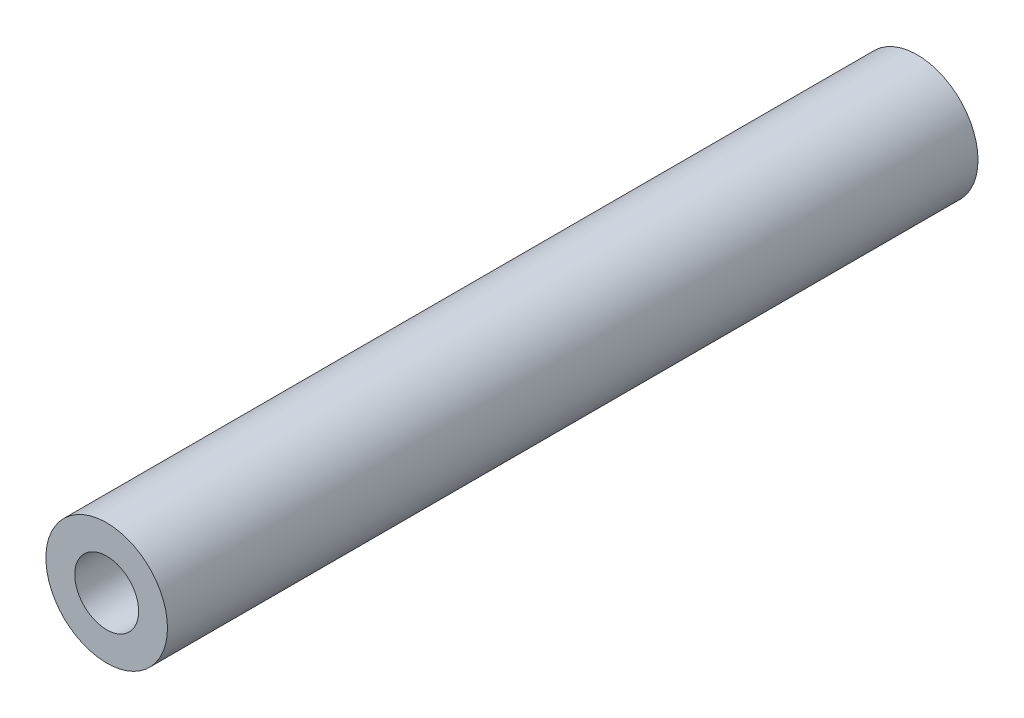
ISO-10303-21;
HEADER;
FILE_DESCRIPTION(('STEP AP214'),'2;1');
FILE_NAME('part.step','',(''),(''),'','','');
FILE_SCHEMA(('AUTOMOTIVE_DESIGN { 1 0 10303 214 1 1 1 1 }'));
ENDSEC;
DATA;
#1=APPLICATION_CONTEXT('core data for automotive mechanical design processes');
#2=APPLICATION_PROTOCOL_DEFINITION('international standard','automotive_design',2000,#1);
#3=PRODUCT_CONTEXT('',#1,'mechanical');
#4=PRODUCT('Part','Part','',(#3));
#5=PRODUCT_RELATED_PRODUCT_CATEGORY('part','',(#4));
#6=PRODUCT_DEFINITION_FORMATION('','',#4);
#7=PRODUCT_DEFINITION_CONTEXT('part definition',#1,'design');
#8=PRODUCT_DEFINITION('design','',#6,#7);
#9=PRODUCT_DEFINITION_SHAPE('','',#8);
#10=(LENGTH_UNIT() NAMED_UNIT(*) SI_UNIT(.MILLI.,.METRE.));
#11=(NAMED_UNIT(*) PLANE_ANGLE_UNIT() SI_UNIT($,.RADIAN.));
#12=(NAMED_UNIT(*) SI_UNIT($,.STERADIAN.) SOLID_ANGLE_UNIT());
#13=UNCERTAINTY_MEASURE_WITH_UNIT(LENGTH_MEASURE(1.E-05),#10,'distance_accuracy_value','');
#14=(GEOMETRIC_REPRESENTATION_CONTEXT(3) GLOBAL_UNCERTAINTY_ASSIGNED_CONTEXT((#13)) GLOBAL_UNIT_ASSIGNED_CONTEXT((#10,
#11,#12)) REPRESENTATION_CONTEXT('',''));
#15=CARTESIAN_POINT('',(0.,0.,0.));
#16=DIRECTION('',(0.,0.,1.));
#17=DIRECTION('',(1.,0.,0.));
#18=AXIS2_PLACEMENT_3D('',#15,#16,#17);
#19=CARTESIAN_POINT('',(0.,0.,40.));
#20=DIRECTION('',(0.,0.,-1.));
#21=DIRECTION('',(-1.,0.,0.));
#22=AXIS2_PLACEMENT_3D('',#19,#20,#21);
#23=CYLINDRICAL_SURFACE('',#22,3.);
#24=CARTESIAN_POINT('',(0.,0.,40.));
#25=DIRECTION('',(0.,0.,1.));
#26=DIRECTION('',(1.,0.,0.));
#27=AXIS2_PLACEMENT_3D('',#24,#25,#26);
#28=CIRCLE('',#27,3.);
#29=CARTESIAN_POINT('',(3.,0.,40.));
#30=VERTEX_POINT('',#29);
#31=EDGE_CURVE('E11',#30,#30,#28,.T.);
#32=ORIENTED_EDGE('',*,*,#31,.F.);
#33=EDGE_LOOP('',(#32));
#34=FACE_BOUND('',#33,.T.);
#35=CARTESIAN_POINT('',(0.,0.,0.));
#36=DIRECTION('',(0.,0.,1.));
#37=DIRECTION('',(1.,0.,0.));
#38=AXIS2_PLACEMENT_3D('',#35,#36,#37);
#39=CIRCLE('',#38,3.);
#40=CARTESIAN_POINT('',(3.,0.,0.));
#41=VERTEX_POINT('',#40);
#42=EDGE_CURVE('E36',#41,#41,#39,.T.);
#43=ORIENTED_EDGE('',*,*,#42,.T.);
#44=EDGE_LOOP('',(#43));
#45=FACE_BOUND('',#44,.T.);
#46=ADVANCED_FACE('F33',(#34,#45),#23,.T.);
#47=CARTESIAN_POINT('',(0.,0.,40.));
#48=DIRECTION('',(0.,0.,1.));
#49=DIRECTION('',(1.,0.,0.));
#50=AXIS2_PLACEMENT_3D('',#47,#48,#49);
#51=PLANE('',#50);
#52=CARTESIAN_POINT('',(0.,0.,40.));
#53=DIRECTION('',(0.,0.,1.));
#54=DIRECTION('',(1.,0.,0.));
#55=AXIS2_PLACEMENT_3D('',#52,#53,#54);
#56=CIRCLE('',#55,1.57499999999999);
#57=CARTESIAN_POINT('',(1.57499999999999,0.,40.));
#58=VERTEX_POINT('',#57);
#59=EDGE_CURVE('E57',#58,#58,#56,.T.);
#60=ORIENTED_EDGE('',*,*,#59,.F.);
#61=EDGE_LOOP('',(#60));
#62=FACE_BOUND('',#61,.T.);
#63=ORIENTED_EDGE('',*,*,#31,.T.);
#64=EDGE_LOOP('',(#63));
#65=FACE_BOUND('',#64,.T.);
#66=ADVANCED_FACE('F75',(#62,#65),#51,.T.);
#67=CARTESIAN_POINT('',(0.,0.,0.));
#68=DIRECTION('',(0.,0.,1.));
#69=DIRECTION('',(1.,0.,0.));
#70=AXIS2_PLACEMENT_3D('',#67,#68,#69);
#71=PLANE('',#70);
#72=CARTESIAN_POINT('',(0.,0.,0.));
#73=DIRECTION('',(0.,0.,-1.));
#74=DIRECTION('',(-1.,0.,0.));
#75=AXIS2_PLACEMENT_3D('',#72,#73,#74);
#76=CIRCLE('',#75,1.57499999999999);
#77=CARTESIAN_POINT('',(-1.57499999999999,0.,0.));
#78=VERTEX_POINT('',#77);
#79=EDGE_CURVE('E56',#78,#78,#76,.T.);
#80=ORIENTED_EDGE('',*,*,#79,.F.);
#81=EDGE_LOOP('',(#80));
#82=FACE_BOUND('',#81,.T.);
#83=ORIENTED_EDGE('',*,*,#42,.F.);
#84=EDGE_LOOP('',(#83));
#85=FACE_BOUND('',#84,.T.);
#86=ADVANCED_FACE('F72',(#82,#85),#71,.F.);
#87=CARTESIAN_POINT('',(0.,0.,4.));
#88=DIRECTION('',(0.,0.,-1.));
#89=DIRECTION('',(-1.,0.,0.));
#90=AXIS2_PLACEMENT_3D('',#87,#88,#89);
#91=CONICAL_SURFACE('',#90,1.57499999999999,1.02974425867665);
#92=CARTESIAN_POINT('',(0.,0.,4.94635547496841));
#93=VERTEX_POINT('',#92);
#94=VERTEX_LOOP('',#93);
#95=FACE_BOUND('',#94,.T.);
#96=CARTESIAN_POINT('',(0.,0.,4.));
#97=DIRECTION('',(0.,0.,-1.));
#98=DIRECTION('',(-1.,0.,0.));
#99=AXIS2_PLACEMENT_3D('',#96,#97,#98);
#100=CIRCLE('',#99,1.57499999999999);
#101=CARTESIAN_POINT('',(-1.57499999999999,0.,4.));
#102=VERTEX_POINT('',#101);
#103=EDGE_CURVE('E60',#102,#102,#100,.T.);
#104=ORIENTED_EDGE('',*,*,#103,.T.);
#105=EDGE_LOOP('',(#104));
#106=FACE_BOUND('',#105,.T.);
#107=ADVANCED_FACE('F74',(#95,#106),#91,.F.);
#108=CARTESIAN_POINT('',(0.,0.,0.));
#109=DIRECTION('',(0.,0.,-1.));
#110=DIRECTION('',(-1.,0.,0.));
#111=AXIS2_PLACEMENT_3D('',#108,#109,#110);
#112=CYLINDRICAL_SURFACE('',#111,1.57499999999999);
#113=ORIENTED_EDGE('',*,*,#103,.F.);
#114=EDGE_LOOP('',(#113));
#115=FACE_BOUND('',#114,.T.);
#116=ORIENTED_EDGE('',*,*,#79,.T.);
#117=EDGE_LOOP('',(#116));
#118=FACE_BOUND('',#117,.T.);
#119=ADVANCED_FACE('F50',(#115,#118),#112,.F.);
#120=CARTESIAN_POINT('',(0.,0.,36.));
#121=DIRECTION('',(0.,0.,1.));
#122=DIRECTION('',(1.,0.,0.));
#123=AXIS2_PLACEMENT_3D('',#120,#121,#122);
#124=CONICAL_SURFACE('',#123,1.57499999999999,1.02974425867665);
#125=CARTESIAN_POINT('',(0.,0.,35.0536445250316));
#126=VERTEX_POINT('',#125);
#127=VERTEX_LOOP('',#126);
#128=FACE_BOUND('',#127,.T.);
#129=CARTESIAN_POINT('',(0.,0.,36.));
#130=DIRECTION('',(0.,0.,1.));
#131=DIRECTION('',(1.,0.,0.));
#132=AXIS2_PLACEMENT_3D('',#129,#130,#131);
#133=CIRCLE('',#132,1.57499999999999);
#134=CARTESIAN_POINT('',(1.57499999999999,0.,36.));
#135=VERTEX_POINT('',#134);
#136=EDGE_CURVE('E54',#135,#135,#133,.T.);
#137=ORIENTED_EDGE('',*,*,#136,.T.);
#138=EDGE_LOOP('',(#137));
#139=FACE_BOUND('',#138,.T.);
#140=ADVANCED_FACE('F46',(#128,#139),#124,.F.);
#141=CARTESIAN_POINT('',(0.,0.,40.));
#142=DIRECTION('',(0.,0.,1.));
#143=DIRECTION('',(1.,0.,0.));
#144=AXIS2_PLACEMENT_3D('',#141,#142,#143);
#145=CYLINDRICAL_SURFACE('',#144,1.57499999999999);
#146=ORIENTED_EDGE('',*,*,#136,.F.);
#147=EDGE_LOOP('',(#146));
#148=FACE_BOUND('',#147,.T.);
#149=ORIENTED_EDGE('',*,*,#59,.T.);
#150=EDGE_LOOP('',(#149));
#151=FACE_BOUND('',#150,.T.);
#152=ADVANCED_FACE('F49',(#148,#151),#145,.F.);
#153=CLOSED_SHELL('',(#46,#66,#86,#107,#119,#140,#152));
#154=MANIFOLD_SOLID_BREP('B2',#153);
#155=ADVANCED_BREP_SHAPE_REPRESENTATION('',(#18,#154),#14);
#156=SHAPE_DEFINITION_REPRESENTATION(#9,#155);
ENDSEC;
END-ISO-10303-21;
